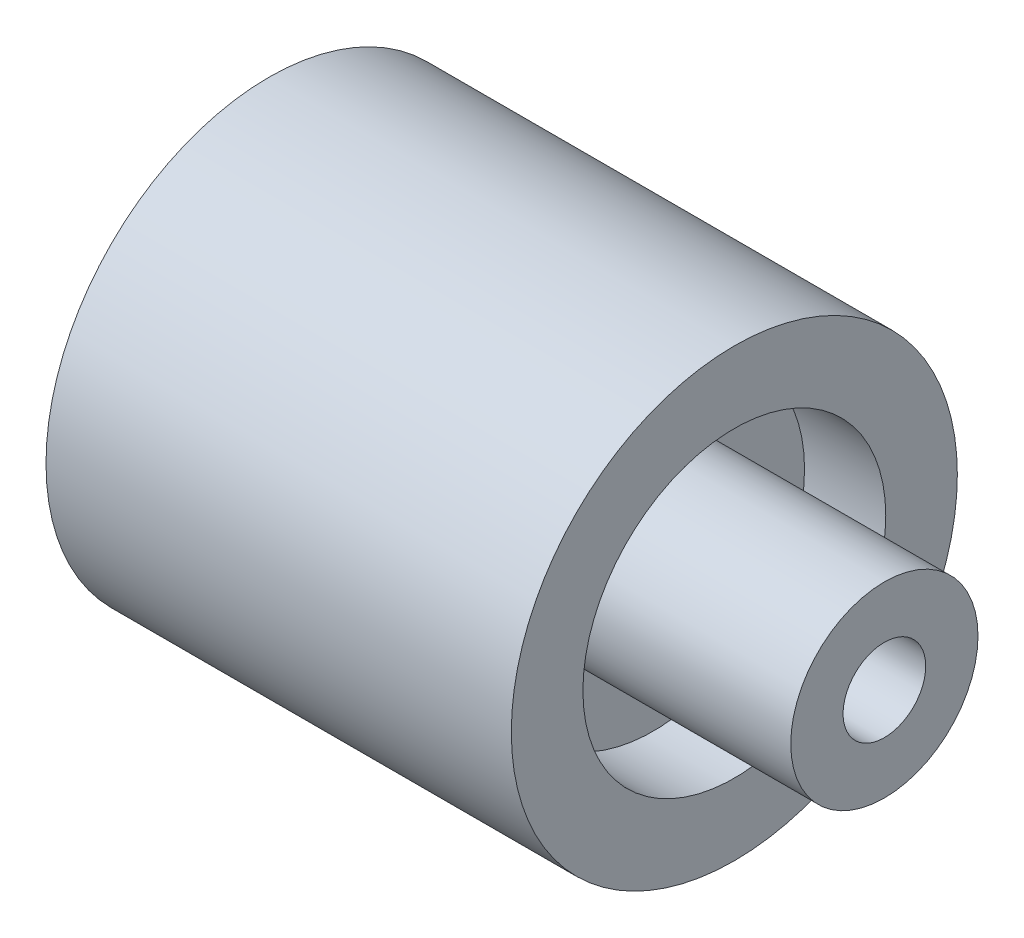
ISO-10303-21;
HEADER;
FILE_DESCRIPTION(('STEP AP214'),'2;1');
FILE_NAME('part.step','',(''),(''),'','','');
FILE_SCHEMA(('AUTOMOTIVE_DESIGN { 1 0 10303 214 1 1 1 1 }'));
ENDSEC;
DATA;
#1=APPLICATION_CONTEXT('core data for automotive mechanical design processes');
#2=APPLICATION_PROTOCOL_DEFINITION('international standard','automotive_design',2000,#1);
#3=PRODUCT_CONTEXT('',#1,'mechanical');
#4=PRODUCT('Part','Part','',(#3));
#5=PRODUCT_RELATED_PRODUCT_CATEGORY('part','',(#4));
#6=PRODUCT_DEFINITION_FORMATION('','',#4);
#7=PRODUCT_DEFINITION_CONTEXT('part definition',#1,'design');
#8=PRODUCT_DEFINITION('design','',#6,#7);
#9=PRODUCT_DEFINITION_SHAPE('','',#8);
#10=(LENGTH_UNIT() NAMED_UNIT(*) SI_UNIT(.MILLI.,.METRE.));
#11=(NAMED_UNIT(*) PLANE_ANGLE_UNIT() SI_UNIT($,.RADIAN.));
#12=(NAMED_UNIT(*) SI_UNIT($,.STERADIAN.) SOLID_ANGLE_UNIT());
#13=UNCERTAINTY_MEASURE_WITH_UNIT(LENGTH_MEASURE(1.E-05),#10,'distance_accuracy_value','');
#14=(GEOMETRIC_REPRESENTATION_CONTEXT(3) GLOBAL_UNCERTAINTY_ASSIGNED_CONTEXT((#13)) GLOBAL_UNIT_ASSIGNED_CONTEXT((#10,
#11,#12)) REPRESENTATION_CONTEXT('',''));
#15=CARTESIAN_POINT('',(0.,0.,0.));
#16=DIRECTION('',(0.,0.,1.));
#17=DIRECTION('',(1.,0.,0.));
#18=AXIS2_PLACEMENT_3D('',#15,#16,#17);
#19=CARTESIAN_POINT('',(11.,0.,0.));
#20=DIRECTION('',(1.,0.,0.));
#21=DIRECTION('',(0.,0.,-1.));
#22=AXIS2_PLACEMENT_3D('',#19,#20,#21);
#23=PLANE('',#22);
#24=CARTESIAN_POINT('',(11.,0.,0.));
#25=DIRECTION('',(1.,0.,0.));
#26=DIRECTION('',(0.,0.,-1.));
#27=AXIS2_PLACEMENT_3D('',#24,#25,#26);
#28=CIRCLE('',#27,3.4);
#29=CARTESIAN_POINT('',(11.,0.,-3.4));
#30=VERTEX_POINT('',#29);
#31=EDGE_CURVE('E35',#30,#30,#28,.F.);
#32=ORIENTED_EDGE('',*,*,#31,.T.);
#33=EDGE_LOOP('',(#32));
#34=FACE_BOUND('',#33,.T.);
#35=CARTESIAN_POINT('',(11.,0.,0.));
#36=DIRECTION('',(1.,0.,0.));
#37=DIRECTION('',(0.,0.,-1.));
#38=AXIS2_PLACEMENT_3D('',#35,#36,#37);
#39=CIRCLE('',#38,5.5);
#40=CARTESIAN_POINT('',(11.,0.,-5.5));
#41=VERTEX_POINT('',#40);
#42=EDGE_CURVE('E52',#41,#41,#39,.F.);
#43=ORIENTED_EDGE('',*,*,#42,.F.);
#44=EDGE_LOOP('',(#43));
#45=FACE_BOUND('',#44,.T.);
#46=ADVANCED_FACE('F31',(#34,#45),#23,.T.);
#47=CARTESIAN_POINT('',(0.,0.,0.));
#48=DIRECTION('',(1.,0.,0.));
#49=DIRECTION('',(0.,0.,-1.));
#50=AXIS2_PLACEMENT_3D('',#47,#48,#49);
#51=PLANE('',#50);
#52=CARTESIAN_POINT('',(0.,0.,0.));
#53=DIRECTION('',(1.,0.,0.));
#54=DIRECTION('',(0.,0.,-1.));
#55=AXIS2_PLACEMENT_3D('',#52,#53,#54);
#56=CIRCLE('',#55,1.5);
#57=CARTESIAN_POINT('',(0.,0.,-1.5));
#58=VERTEX_POINT('',#57);
#59=EDGE_CURVE('E46',#58,#58,#56,.T.);
#60=ORIENTED_EDGE('',*,*,#59,.T.);
#61=EDGE_LOOP('',(#60));
#62=FACE_BOUND('',#61,.T.);
#63=CARTESIAN_POINT('',(0.,0.,0.));
#64=DIRECTION('',(1.,0.,0.));
#65=DIRECTION('',(0.,0.,-1.));
#66=AXIS2_PLACEMENT_3D('',#63,#64,#65);
#67=CIRCLE('',#66,5.5);
#68=CARTESIAN_POINT('',(0.,0.,-5.5));
#69=VERTEX_POINT('',#68);
#70=EDGE_CURVE('E10',#69,#69,#67,.T.);
#71=ORIENTED_EDGE('',*,*,#70,.F.);
#72=EDGE_LOOP('',(#71));
#73=FACE_BOUND('',#72,.T.);
#74=ADVANCED_FACE('F33',(#62,#73),#51,.F.);
#75=CARTESIAN_POINT('',(19.4,0.,0.));
#76=DIRECTION('',(-1.,0.,0.));
#77=DIRECTION('',(0.,0.,1.));
#78=AXIS2_PLACEMENT_3D('',#75,#76,#77);
#79=CYLINDRICAL_SURFACE('',#78,3.4);
#80=ORIENTED_EDGE('',*,*,#31,.F.);
#81=EDGE_LOOP('',(#80));
#82=FACE_BOUND('',#81,.T.);
#83=CARTESIAN_POINT('',(19.4,0.,0.));
#84=DIRECTION('',(1.,0.,0.));
#85=DIRECTION('',(0.,0.,-1.));
#86=AXIS2_PLACEMENT_3D('',#83,#84,#85);
#87=CIRCLE('',#86,3.4);
#88=CARTESIAN_POINT('',(19.4,0.,-3.4));
#89=VERTEX_POINT('',#88);
#90=EDGE_CURVE('E42',#89,#89,#87,.T.);
#91=ORIENTED_EDGE('',*,*,#90,.F.);
#92=EDGE_LOOP('',(#91));
#93=FACE_BOUND('',#92,.T.);
#94=ADVANCED_FACE('F94',(#82,#93),#79,.T.);
#95=CARTESIAN_POINT('',(19.4,0.,0.));
#96=DIRECTION('',(1.,0.,0.));
#97=DIRECTION('',(0.,0.,-1.));
#98=AXIS2_PLACEMENT_3D('',#95,#96,#97);
#99=PLANE('',#98);
#100=CARTESIAN_POINT('',(19.4,0.,0.));
#101=DIRECTION('',(1.,0.,0.));
#102=DIRECTION('',(0.,0.,-1.));
#103=AXIS2_PLACEMENT_3D('',#100,#101,#102);
#104=CIRCLE('',#103,1.5);
#105=CARTESIAN_POINT('',(19.4,0.,-1.5));
#106=VERTEX_POINT('',#105);
#107=EDGE_CURVE('E49',#106,#106,#104,.T.);
#108=ORIENTED_EDGE('',*,*,#107,.F.);
#109=EDGE_LOOP('',(#108));
#110=FACE_BOUND('',#109,.T.);
#111=ORIENTED_EDGE('',*,*,#90,.T.);
#112=EDGE_LOOP('',(#111));
#113=FACE_BOUND('',#112,.T.);
#114=ADVANCED_FACE('F100',(#110,#113),#99,.T.);
#115=CARTESIAN_POINT('',(-6.35,0.,0.));
#116=DIRECTION('',(1.,0.,0.));
#117=DIRECTION('',(0.,0.,-1.));
#118=AXIS2_PLACEMENT_3D('',#115,#116,#117);
#119=CYLINDRICAL_SURFACE('',#118,1.5);
#120=ORIENTED_EDGE('',*,*,#107,.T.);
#121=EDGE_LOOP('',(#120));
#122=FACE_BOUND('',#121,.T.);
#123=ORIENTED_EDGE('',*,*,#59,.F.);
#124=EDGE_LOOP('',(#123));
#125=FACE_BOUND('',#124,.T.);
#126=ADVANCED_FACE('F87',(#122,#125),#119,.F.);
#127=CARTESIAN_POINT('',(-2.95,0.,0.));
#128=DIRECTION('',(1.,0.,0.));
#129=DIRECTION('',(0.,0.,-1.));
#130=AXIS2_PLACEMENT_3D('',#127,#128,#129);
#131=CYLINDRICAL_SURFACE('',#130,5.5);
#132=CARTESIAN_POINT('',(-2.95,0.,0.));
#133=DIRECTION('',(-1.,0.,0.));
#134=DIRECTION('',(0.,0.,1.));
#135=AXIS2_PLACEMENT_3D('',#132,#133,#134);
#136=CIRCLE('',#135,5.5);
#137=CARTESIAN_POINT('',(-2.95,0.,5.5));
#138=VERTEX_POINT('',#137);
#139=EDGE_CURVE('E58',#138,#138,#136,.T.);
#140=ORIENTED_EDGE('',*,*,#139,.T.);
#141=EDGE_LOOP('',(#140));
#142=FACE_BOUND('',#141,.T.);
#143=ORIENTED_EDGE('',*,*,#70,.T.);
#144=EDGE_LOOP('',(#143));
#145=FACE_BOUND('',#144,.T.);
#146=ADVANCED_FACE('F76',(#142,#145),#131,.F.);
#147=CARTESIAN_POINT('',(-2.95,0.,0.));
#148=DIRECTION('',(-1.,0.,0.));
#149=DIRECTION('',(0.,0.,1.));
#150=AXIS2_PLACEMENT_3D('',#147,#148,#149);
#151=PLANE('',#150);
#152=CARTESIAN_POINT('',(-2.95,0.,0.));
#153=DIRECTION('',(-1.,0.,0.));
#154=DIRECTION('',(0.,0.,1.));
#155=AXIS2_PLACEMENT_3D('',#152,#153,#154);
#156=CIRCLE('',#155,8.1);
#157=CARTESIAN_POINT('',(-2.95,0.,8.1));
#158=VERTEX_POINT('',#157);
#159=EDGE_CURVE('E55',#158,#158,#156,.T.);
#160=ORIENTED_EDGE('',*,*,#159,.T.);
#161=EDGE_LOOP('',(#160));
#162=FACE_BOUND('',#161,.T.);
#163=ORIENTED_EDGE('',*,*,#139,.F.);
#164=EDGE_LOOP('',(#163));
#165=FACE_BOUND('',#164,.T.);
#166=ADVANCED_FACE('F82',(#162,#165),#151,.T.);
#167=CARTESIAN_POINT('',(-2.95,0.,0.));
#168=DIRECTION('',(1.,0.,0.));
#169=DIRECTION('',(0.,0.,-1.));
#170=AXIS2_PLACEMENT_3D('',#167,#168,#169);
#171=CYLINDRICAL_SURFACE('',#170,8.1);
#172=ORIENTED_EDGE('',*,*,#159,.F.);
#173=EDGE_LOOP('',(#172));
#174=FACE_BOUND('',#173,.T.);
#175=CARTESIAN_POINT('',(13.95,0.,0.));
#176=DIRECTION('',(-1.,0.,0.));
#177=DIRECTION('',(0.,0.,1.));
#178=AXIS2_PLACEMENT_3D('',#175,#176,#177);
#179=CIRCLE('',#178,8.1);
#180=CARTESIAN_POINT('',(13.95,0.,8.1));
#181=VERTEX_POINT('',#180);
#182=EDGE_CURVE('E61',#181,#181,#179,.T.);
#183=ORIENTED_EDGE('',*,*,#182,.T.);
#184=EDGE_LOOP('',(#183));
#185=FACE_BOUND('',#184,.T.);
#186=ADVANCED_FACE('F73',(#174,#185),#171,.T.);
#187=ORIENTED_EDGE('',*,*,#42,.T.);
#188=EDGE_LOOP('',(#187));
#189=FACE_BOUND('',#188,.T.);
#190=CARTESIAN_POINT('',(13.95,0.,0.));
#191=DIRECTION('',(-1.,0.,0.));
#192=DIRECTION('',(0.,0.,1.));
#193=AXIS2_PLACEMENT_3D('',#190,#191,#192);
#194=CIRCLE('',#193,5.5);
#195=CARTESIAN_POINT('',(13.95,0.,5.5));
#196=VERTEX_POINT('',#195);
#197=EDGE_CURVE('E64',#196,#196,#194,.T.);
#198=ORIENTED_EDGE('',*,*,#197,.F.);
#199=EDGE_LOOP('',(#198));
#200=FACE_BOUND('',#199,.T.);
#201=ADVANCED_FACE('F71',(#189,#200),#131,.F.);
#202=CARTESIAN_POINT('',(13.95,0.,0.));
#203=DIRECTION('',(-1.,0.,0.));
#204=DIRECTION('',(0.,0.,1.));
#205=AXIS2_PLACEMENT_3D('',#202,#203,#204);
#206=PLANE('',#205);
#207=ORIENTED_EDGE('',*,*,#197,.T.);
#208=EDGE_LOOP('',(#207));
#209=FACE_BOUND('',#208,.T.);
#210=ORIENTED_EDGE('',*,*,#182,.F.);
#211=EDGE_LOOP('',(#210));
#212=FACE_BOUND('',#211,.T.);
#213=ADVANCED_FACE('F68',(#209,#212),#206,.F.);
#214=CLOSED_SHELL('',(#46,#74,#94,#114,#126,#146,#166,#186,#201,#213));
#215=MANIFOLD_SOLID_BREP('B2',#214);
#216=ADVANCED_BREP_SHAPE_REPRESENTATION('',(#18,#215),#14);
#217=SHAPE_DEFINITION_REPRESENTATION(#9,#216);
ENDSEC;
END-ISO-10303-21;
